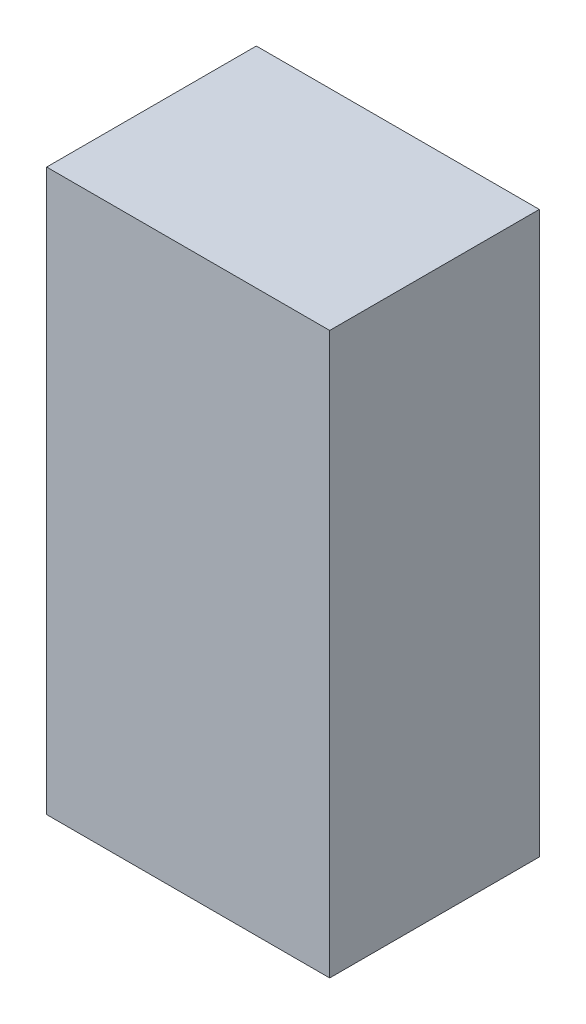
ISO-10303-21;
HEADER;
FILE_DESCRIPTION(('STEP AP214'),'2;1');
FILE_NAME('part.step','',(''),(''),'','','');
FILE_SCHEMA(('AUTOMOTIVE_DESIGN { 1 0 10303 214 1 1 1 1 }'));
ENDSEC;
DATA;
#1=APPLICATION_CONTEXT('core data for automotive mechanical design processes');
#2=APPLICATION_PROTOCOL_DEFINITION('international standard','automotive_design',2000,#1);
#3=PRODUCT_CONTEXT('',#1,'mechanical');
#4=PRODUCT('Part','Part','',(#3));
#5=PRODUCT_RELATED_PRODUCT_CATEGORY('part','',(#4));
#6=PRODUCT_DEFINITION_FORMATION('','',#4);
#7=PRODUCT_DEFINITION_CONTEXT('part definition',#1,'design');
#8=PRODUCT_DEFINITION('design','',#6,#7);
#9=PRODUCT_DEFINITION_SHAPE('','',#8);
#10=(LENGTH_UNIT() NAMED_UNIT(*) SI_UNIT(.MILLI.,.METRE.));
#11=(NAMED_UNIT(*) PLANE_ANGLE_UNIT() SI_UNIT($,.RADIAN.));
#12=(NAMED_UNIT(*) SI_UNIT($,.STERADIAN.) SOLID_ANGLE_UNIT());
#13=UNCERTAINTY_MEASURE_WITH_UNIT(LENGTH_MEASURE(1.E-05),#10,'distance_accuracy_value','');
#14=(GEOMETRIC_REPRESENTATION_CONTEXT(3) GLOBAL_UNCERTAINTY_ASSIGNED_CONTEXT((#13)) GLOBAL_UNIT_ASSIGNED_CONTEXT((#10,
#11,#12)) REPRESENTATION_CONTEXT('',''));
#15=CARTESIAN_POINT('',(0.,0.,0.));
#16=DIRECTION('',(0.,0.,1.));
#17=DIRECTION('',(1.,0.,0.));
#18=AXIS2_PLACEMENT_3D('',#15,#16,#17);
#19=CARTESIAN_POINT('',(-0.67499992,-1.3375005,1.00000054));
#20=DIRECTION('',(0.,0.,-1.));
#21=DIRECTION('',(-1.,0.,0.));
#22=AXIS2_PLACEMENT_3D('',#19,#20,#21);
#23=PLANE('',#22);
#24=DIRECTION('',(0.,1.,0.));
#25=VECTOR('',#24,1.);
#26=CARTESIAN_POINT('',(0.67499992,-1.3375005,1.00000054));
#27=LINE('',#26,#25);
#28=CARTESIAN_POINT('',(0.67499992,-1.3375005,1.00000054));
#29=VERTEX_POINT('',#28);
#30=CARTESIAN_POINT('',(0.67499992,1.3375005,1.00000054));
#31=VERTEX_POINT('',#30);
#32=EDGE_CURVE('E55',#29,#31,#27,.T.);
#33=ORIENTED_EDGE('',*,*,#32,.T.);
#34=DIRECTION('',(1.,0.,0.));
#35=VECTOR('',#34,1.);
#36=CARTESIAN_POINT('',(0.67499992,1.3375005,1.00000054));
#37=LINE('',#36,#35);
#38=CARTESIAN_POINT('',(-0.67499992,1.3375005,1.00000054));
#39=VERTEX_POINT('',#38);
#40=EDGE_CURVE('E58',#31,#39,#37,.F.);
#41=ORIENTED_EDGE('',*,*,#40,.T.);
#42=DIRECTION('',(0.,1.,0.));
#43=VECTOR('',#42,1.);
#44=CARTESIAN_POINT('',(-0.67499992,1.3375005,1.00000054));
#45=LINE('',#44,#43);
#46=CARTESIAN_POINT('',(-0.67499992,-1.3375005,1.00000054));
#47=VERTEX_POINT('',#46);
#48=EDGE_CURVE('E60',#39,#47,#45,.F.);
#49=ORIENTED_EDGE('',*,*,#48,.T.);
#50=DIRECTION('',(-1.,0.,0.));
#51=VECTOR('',#50,1.);
#52=CARTESIAN_POINT('',(-0.67499992,-1.3375005,1.00000054));
#53=LINE('',#52,#51);
#54=EDGE_CURVE('E20',#29,#47,#53,.T.);
#55=ORIENTED_EDGE('',*,*,#54,.F.);
#56=EDGE_LOOP('',(#33,#41,#49,#55));
#57=FACE_BOUND('',#56,.T.);
#58=ADVANCED_FACE('F17',(#57),#23,.F.);
#59=CARTESIAN_POINT('',(-0.67499992,1.3375005,0.));
#60=DIRECTION('',(1.,0.,0.));
#61=DIRECTION('',(0.,0.,-1.));
#62=AXIS2_PLACEMENT_3D('',#59,#60,#61);
#63=PLANE('',#62);
#64=DIRECTION('',(0.,0.,1.));
#65=VECTOR('',#64,1.);
#66=CARTESIAN_POINT('',(-0.67499992,-1.3375005,0.));
#67=LINE('',#66,#65);
#68=CARTESIAN_POINT('',(-0.67499992,-1.3375005,0.));
#69=VERTEX_POINT('',#68);
#70=EDGE_CURVE('E71',#69,#47,#67,.T.);
#71=ORIENTED_EDGE('',*,*,#70,.T.);
#72=ORIENTED_EDGE('',*,*,#48,.F.);
#73=DIRECTION('',(0.,0.,-1.));
#74=VECTOR('',#73,1.);
#75=CARTESIAN_POINT('',(-0.67499992,1.3375005,0.));
#76=LINE('',#75,#74);
#77=CARTESIAN_POINT('',(-0.67499992,1.3375005,0.));
#78=VERTEX_POINT('',#77);
#79=EDGE_CURVE('E65',#39,#78,#76,.T.);
#80=ORIENTED_EDGE('',*,*,#79,.T.);
#81=DIRECTION('',(0.,1.,0.));
#82=VECTOR('',#81,1.);
#83=CARTESIAN_POINT('',(-0.67499992,-1.3375005,0.));
#84=LINE('',#83,#82);
#85=EDGE_CURVE('E83',#69,#78,#84,.T.);
#86=ORIENTED_EDGE('',*,*,#85,.F.);
#87=EDGE_LOOP('',(#71,#72,#80,#86));
#88=FACE_BOUND('',#87,.T.);
#89=ADVANCED_FACE('F68',(#88),#63,.F.);
#90=CARTESIAN_POINT('',(0.67499992,1.3375005,0.));
#91=DIRECTION('',(0.,-1.,0.));
#92=DIRECTION('',(0.,0.,-1.));
#93=AXIS2_PLACEMENT_3D('',#90,#91,#92);
#94=PLANE('',#93);
#95=ORIENTED_EDGE('',*,*,#79,.F.);
#96=ORIENTED_EDGE('',*,*,#40,.F.);
#97=DIRECTION('',(0.,0.,1.));
#98=VECTOR('',#97,1.);
#99=CARTESIAN_POINT('',(0.67499992,1.3375005,0.));
#100=LINE('',#99,#98);
#101=CARTESIAN_POINT('',(0.67499992,1.3375005,0.));
#102=VERTEX_POINT('',#101);
#103=EDGE_CURVE('E77',#31,#102,#100,.F.);
#104=ORIENTED_EDGE('',*,*,#103,.T.);
#105=DIRECTION('',(-1.,0.,0.));
#106=VECTOR('',#105,1.);
#107=CARTESIAN_POINT('',(-0.67499992,1.3375005,0.));
#108=LINE('',#107,#106);
#109=EDGE_CURVE('E74',#78,#102,#108,.F.);
#110=ORIENTED_EDGE('',*,*,#109,.F.);
#111=EDGE_LOOP('',(#95,#96,#104,#110));
#112=FACE_BOUND('',#111,.T.);
#113=ADVANCED_FACE('F72',(#112),#94,.F.);
#114=CARTESIAN_POINT('',(0.67499992,-1.3375005,0.));
#115=DIRECTION('',(-1.,0.,0.));
#116=DIRECTION('',(0.,0.,1.));
#117=AXIS2_PLACEMENT_3D('',#114,#115,#116);
#118=PLANE('',#117);
#119=ORIENTED_EDGE('',*,*,#103,.F.);
#120=ORIENTED_EDGE('',*,*,#32,.F.);
#121=DIRECTION('',(0.,0.,1.));
#122=VECTOR('',#121,1.);
#123=CARTESIAN_POINT('',(0.67499992,-1.3375005,0.));
#124=LINE('',#123,#122);
#125=CARTESIAN_POINT('',(0.67499992,-1.3375005,0.));
#126=VERTEX_POINT('',#125);
#127=EDGE_CURVE('E35',#29,#126,#124,.F.);
#128=ORIENTED_EDGE('',*,*,#127,.T.);
#129=DIRECTION('',(0.,1.,0.));
#130=VECTOR('',#129,1.);
#131=CARTESIAN_POINT('',(0.67499992,-1.3375005,0.));
#132=LINE('',#131,#130);
#133=EDGE_CURVE('E26',#102,#126,#132,.F.);
#134=ORIENTED_EDGE('',*,*,#133,.F.);
#135=EDGE_LOOP('',(#119,#120,#128,#134));
#136=FACE_BOUND('',#135,.T.);
#137=ADVANCED_FACE('F89',(#136),#118,.F.);
#138=CARTESIAN_POINT('',(-0.67499992,-1.3375005,0.));
#139=DIRECTION('',(0.,1.,0.));
#140=DIRECTION('',(0.,0.,1.));
#141=AXIS2_PLACEMENT_3D('',#138,#139,#140);
#142=PLANE('',#141);
#143=ORIENTED_EDGE('',*,*,#127,.F.);
#144=ORIENTED_EDGE('',*,*,#54,.T.);
#145=ORIENTED_EDGE('',*,*,#70,.F.);
#146=DIRECTION('',(-1.,0.,0.));
#147=VECTOR('',#146,1.);
#148=CARTESIAN_POINT('',(-0.67499992,-1.3375005,0.));
#149=LINE('',#148,#147);
#150=EDGE_CURVE('E11',#126,#69,#149,.T.);
#151=ORIENTED_EDGE('',*,*,#150,.F.);
#152=EDGE_LOOP('',(#143,#144,#145,#151));
#153=FACE_BOUND('',#152,.T.);
#154=ADVANCED_FACE('F91',(#153),#142,.F.);
#155=CARTESIAN_POINT('',(-0.67499992,-1.3375005,0.));
#156=DIRECTION('',(0.,0.,-1.));
#157=DIRECTION('',(-1.,0.,0.));
#158=AXIS2_PLACEMENT_3D('',#155,#156,#157);
#159=PLANE('',#158);
#160=ORIENTED_EDGE('',*,*,#133,.T.);
#161=ORIENTED_EDGE('',*,*,#150,.T.);
#162=ORIENTED_EDGE('',*,*,#85,.T.);
#163=ORIENTED_EDGE('',*,*,#109,.T.);
#164=EDGE_LOOP('',(#160,#161,#162,#163));
#165=FACE_BOUND('',#164,.T.);
#166=ADVANCED_FACE('F88',(#165),#159,.T.);
#167=CLOSED_SHELL('',(#58,#89,#113,#137,#154,#166));
#168=MANIFOLD_SOLID_BREP('B1',#167);
#169=ADVANCED_BREP_SHAPE_REPRESENTATION('',(#18,#168),#14);
#170=SHAPE_DEFINITION_REPRESENTATION(#9,#169);
ENDSEC;
END-ISO-10303-21;
